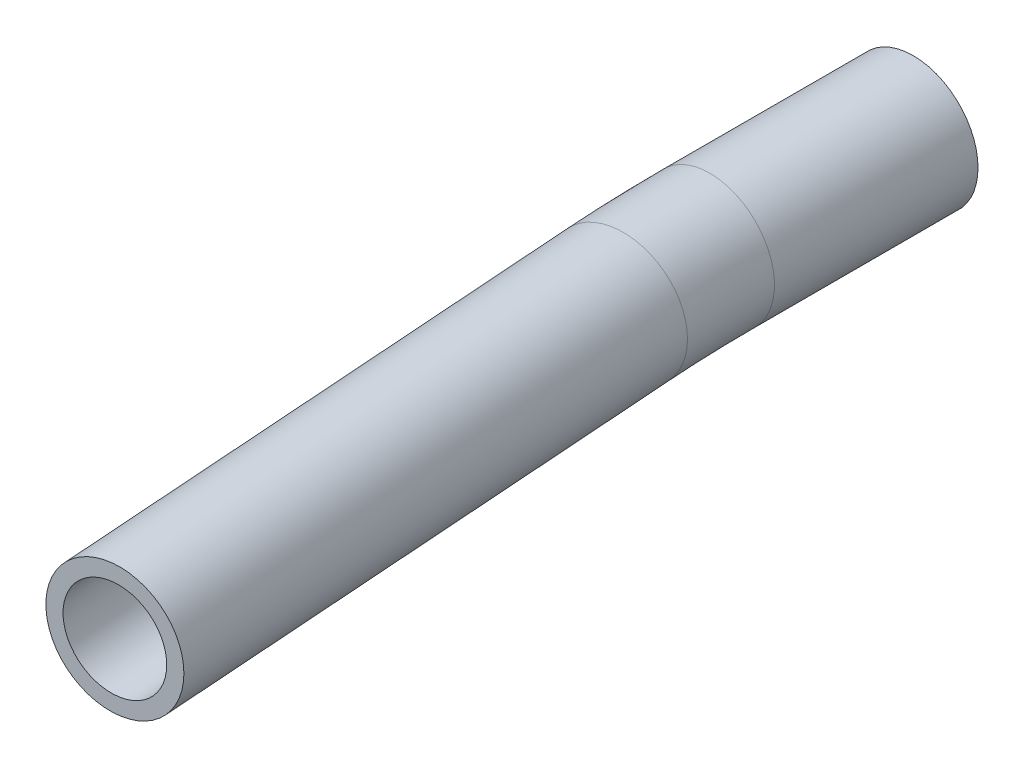
ISO-10303-21;
HEADER;
FILE_DESCRIPTION(('STEP AP214'),'2;1');
FILE_NAME('part.step','',(''),(''),'','','');
FILE_SCHEMA(('AUTOMOTIVE_DESIGN { 1 0 10303 214 1 1 1 1 }'));
ENDSEC;
DATA;
#1=APPLICATION_CONTEXT('core data for automotive mechanical design processes');
#2=APPLICATION_PROTOCOL_DEFINITION('international standard','automotive_design',2000,#1);
#3=PRODUCT_CONTEXT('',#1,'mechanical');
#4=PRODUCT('Part','Part','',(#3));
#5=PRODUCT_RELATED_PRODUCT_CATEGORY('part','',(#4));
#6=PRODUCT_DEFINITION_FORMATION('','',#4);
#7=PRODUCT_DEFINITION_CONTEXT('part definition',#1,'design');
#8=PRODUCT_DEFINITION('design','',#6,#7);
#9=PRODUCT_DEFINITION_SHAPE('','',#8);
#10=(LENGTH_UNIT() NAMED_UNIT(*) SI_UNIT(.MILLI.,.METRE.));
#11=(NAMED_UNIT(*) PLANE_ANGLE_UNIT() SI_UNIT($,.RADIAN.));
#12=(NAMED_UNIT(*) SI_UNIT($,.STERADIAN.) SOLID_ANGLE_UNIT());
#13=UNCERTAINTY_MEASURE_WITH_UNIT(LENGTH_MEASURE(1.E-05),#10,'distance_accuracy_value','');
#14=(GEOMETRIC_REPRESENTATION_CONTEXT(3) GLOBAL_UNCERTAINTY_ASSIGNED_CONTEXT((#13)) GLOBAL_UNIT_ASSIGNED_CONTEXT((#10,
#11,#12)) REPRESENTATION_CONTEXT('',''));
#15=CARTESIAN_POINT('',(0.,0.,0.));
#16=DIRECTION('',(0.,0.,1.));
#17=DIRECTION('',(1.,0.,0.));
#18=AXIS2_PLACEMENT_3D('',#15,#16,#17);
#19=CARTESIAN_POINT('',(0.24359497401758,0.,21.9756473744125));
#20=DIRECTION('',(0.0697564737441256,0.,0.997564050259824));
#21=DIRECTION('',(0.997564050259824,0.,-0.0697564737441256));
#22=AXIS2_PLACEMENT_3D('',#19,#20,#21);
#23=CYLINDRICAL_SURFACE('',#22,4.765);
#24=CARTESIAN_POINT('',(0.24359497401758,0.,21.9756473744125));
#25=DIRECTION('',(0.0697564737441252,0.,0.997564050259824));
#26=DIRECTION('',(0.997564050259824,0.,-0.0697564737441252));
#27=AXIS2_PLACEMENT_3D('',#24,#25,#26);
#28=CIRCLE('',#27,4.765);
#29=CARTESIAN_POINT('',(-4.5097977254705,0.,22.3080369718033));
#30=VERTEX_POINT('',#29);
#31=EDGE_CURVE('E39',#30,#30,#28,.T.);
#32=ORIENTED_EDGE('',*,*,#31,.T.);
#33=EDGE_LOOP('',(#32));
#34=FACE_BOUND('',#33,.T.);
#35=CARTESIAN_POINT('',(3.03385392378261,0.,61.8782093848055));
#36=DIRECTION('',(0.0697564737441252,0.,0.997564050259824));
#37=DIRECTION('',(0.997564050259824,0.,-0.0697564737441252));
#38=AXIS2_PLACEMENT_3D('',#35,#36,#37);
#39=CIRCLE('',#38,4.765);
#40=CARTESIAN_POINT('',(7.78724662327067,0.,61.5458197874148));
#41=VERTEX_POINT('',#40);
#42=EDGE_CURVE('E10',#41,#41,#39,.T.);
#43=ORIENTED_EDGE('',*,*,#42,.F.);
#44=EDGE_LOOP('',(#43));
#45=FACE_BOUND('',#44,.T.);
#46=ADVANCED_FACE('F29',(#34,#45),#23,.T.);
#47=CARTESIAN_POINT('',(0.24359497401758,0.,21.9756473744125));
#48=DIRECTION('',(0.0697564737441256,0.,0.997564050259824));
#49=DIRECTION('',(0.997564050259824,0.,-0.0697564737441256));
#50=AXIS2_PLACEMENT_3D('',#47,#48,#49);
#51=CYLINDRICAL_SURFACE('',#50,3.58);
#52=CARTESIAN_POINT('',(0.24359497401758,0.,21.9756473744125));
#53=DIRECTION('',(0.0697564737441252,0.,0.997564050259824));
#54=DIRECTION('',(0.997564050259824,0.,-0.0697564737441252));
#55=AXIS2_PLACEMENT_3D('',#52,#53,#54);
#56=CIRCLE('',#55,3.58);
#57=CARTESIAN_POINT('',(-3.3276843259126,0.,22.2253755504165));
#58=VERTEX_POINT('',#57);
#59=EDGE_CURVE('E43',#58,#58,#56,.T.);
#60=ORIENTED_EDGE('',*,*,#59,.F.);
#61=EDGE_LOOP('',(#60));
#62=FACE_BOUND('',#61,.T.);
#63=CARTESIAN_POINT('',(3.03385392378261,0.,61.8782093848055));
#64=DIRECTION('',(0.0697564737441252,0.,0.997564050259824));
#65=DIRECTION('',(0.997564050259824,0.,-0.0697564737441252));
#66=AXIS2_PLACEMENT_3D('',#63,#64,#65);
#67=CIRCLE('',#66,3.58);
#68=CARTESIAN_POINT('',(6.60513322371278,0.,61.6284812088015));
#69=VERTEX_POINT('',#68);
#70=EDGE_CURVE('E35',#69,#69,#67,.T.);
#71=ORIENTED_EDGE('',*,*,#70,.T.);
#72=EDGE_LOOP('',(#71));
#73=FACE_BOUND('',#72,.T.);
#74=ADVANCED_FACE('F71',(#62,#73),#51,.F.);
#75=CARTESIAN_POINT('',(100.,0.,15.));
#76=DIRECTION('',(0.,1.,0.));
#77=DIRECTION('',(0.,0.,1.));
#78=AXIS2_PLACEMENT_3D('',#75,#76,#77);
#79=TOROIDAL_SURFACE('',#78,100.,4.765);
#80=CARTESIAN_POINT('',(0.,0.,15.));
#81=DIRECTION('',(0.,0.,1.));
#82=DIRECTION('',(1.,0.,0.));
#83=AXIS2_PLACEMENT_3D('',#80,#81,#82);
#84=CIRCLE('',#83,4.765);
#85=CARTESIAN_POINT('',(-4.76500000000001,0.,15.));
#86=VERTEX_POINT('',#85);
#87=EDGE_CURVE('E48',#86,#86,#84,.T.);
#88=CARTESIAN_POINT('',(100.,0.,15.));
#89=DIRECTION('',(0.,1.,0.));
#90=DIRECTION('',(0.,0.,1.));
#91=AXIS2_PLACEMENT_3D('',#88,#89,#90);
#92=CIRCLE('',#91,104.765);
#93=EDGE_CURVE('',#86,#30,#92,.T.);
#94=ORIENTED_EDGE('',*,*,#87,.T.);
#95=ORIENTED_EDGE('',*,*,#31,.F.);
#96=ORIENTED_EDGE('',*,*,#93,.T.);
#97=ORIENTED_EDGE('',*,*,#93,.F.);
#98=EDGE_LOOP('',(#94,#96,#95,#97));
#99=FACE_BOUND('',#98,.T.);
#100=ADVANCED_FACE('F67',(#99),#79,.T.);
#101=CARTESIAN_POINT('',(100.,0.,15.));
#102=DIRECTION('',(0.,1.,0.));
#103=DIRECTION('',(0.,0.,1.));
#104=AXIS2_PLACEMENT_3D('',#101,#102,#103);
#105=TOROIDAL_SURFACE('',#104,100.,3.58);
#106=CARTESIAN_POINT('',(0.,0.,15.));
#107=DIRECTION('',(0.,0.,1.));
#108=DIRECTION('',(1.,0.,0.));
#109=AXIS2_PLACEMENT_3D('',#106,#107,#108);
#110=CIRCLE('',#109,3.58);
#111=CARTESIAN_POINT('',(-3.58,0.,15.));
#112=VERTEX_POINT('',#111);
#113=EDGE_CURVE('E52',#112,#112,#110,.T.);
#114=CARTESIAN_POINT('',(100.,0.,15.));
#115=DIRECTION('',(0.,1.,0.));
#116=DIRECTION('',(0.,0.,1.));
#117=AXIS2_PLACEMENT_3D('',#114,#115,#116);
#118=CIRCLE('',#117,103.58);
#119=EDGE_CURVE('',#112,#58,#118,.T.);
#120=ORIENTED_EDGE('',*,*,#113,.F.);
#121=ORIENTED_EDGE('',*,*,#59,.T.);
#122=ORIENTED_EDGE('',*,*,#119,.T.);
#123=ORIENTED_EDGE('',*,*,#119,.F.);
#124=EDGE_LOOP('',(#120,#122,#121,#123));
#125=FACE_BOUND('',#124,.T.);
#126=ADVANCED_FACE('F64',(#125),#105,.F.);
#127=CARTESIAN_POINT('',(0.,0.,15.));
#128=DIRECTION('',(0.,0.,-1.));
#129=DIRECTION('',(-1.,0.,0.));
#130=AXIS2_PLACEMENT_3D('',#127,#128,#129);
#131=CYLINDRICAL_SURFACE('',#130,3.58);
#132=ORIENTED_EDGE('',*,*,#113,.T.);
#133=EDGE_LOOP('',(#132));
#134=FACE_BOUND('',#133,.T.);
#135=CARTESIAN_POINT('',(0.,0.,0.));
#136=DIRECTION('',(0.,0.,1.));
#137=DIRECTION('',(1.,0.,0.));
#138=AXIS2_PLACEMENT_3D('',#135,#136,#137);
#139=CIRCLE('',#138,3.58);
#140=CARTESIAN_POINT('',(3.58,0.,0.));
#141=VERTEX_POINT('',#140);
#142=EDGE_CURVE('E53',#141,#141,#139,.T.);
#143=ORIENTED_EDGE('',*,*,#142,.F.);
#144=EDGE_LOOP('',(#143));
#145=FACE_BOUND('',#144,.T.);
#146=ADVANCED_FACE('F61',(#134,#145),#131,.F.);
#147=CARTESIAN_POINT('',(0.,0.,15.));
#148=DIRECTION('',(0.,0.,-1.));
#149=DIRECTION('',(-1.,0.,0.));
#150=AXIS2_PLACEMENT_3D('',#147,#148,#149);
#151=CYLINDRICAL_SURFACE('',#150,4.765);
#152=ORIENTED_EDGE('',*,*,#87,.F.);
#153=EDGE_LOOP('',(#152));
#154=FACE_BOUND('',#153,.T.);
#155=CARTESIAN_POINT('',(0.,0.,0.));
#156=DIRECTION('',(0.,0.,1.));
#157=DIRECTION('',(1.,0.,0.));
#158=AXIS2_PLACEMENT_3D('',#155,#156,#157);
#159=CIRCLE('',#158,4.765);
#160=CARTESIAN_POINT('',(4.765,0.,0.));
#161=VERTEX_POINT('',#160);
#162=EDGE_CURVE('E49',#161,#161,#159,.T.);
#163=ORIENTED_EDGE('',*,*,#162,.T.);
#164=EDGE_LOOP('',(#163));
#165=FACE_BOUND('',#164,.T.);
#166=ADVANCED_FACE('F83',(#154,#165),#151,.T.);
#167=CARTESIAN_POINT('',(3.03385392378261,0.,61.8782093848055));
#168=DIRECTION('',(0.0697564737441252,0.,0.997564050259824));
#169=DIRECTION('',(0.997564050259824,0.,-0.0697564737441252));
#170=AXIS2_PLACEMENT_3D('',#167,#168,#169);
#171=PLANE('',#170);
#172=ORIENTED_EDGE('',*,*,#70,.F.);
#173=EDGE_LOOP('',(#172));
#174=FACE_BOUND('',#173,.T.);
#175=ORIENTED_EDGE('',*,*,#42,.T.);
#176=EDGE_LOOP('',(#175));
#177=FACE_BOUND('',#176,.T.);
#178=ADVANCED_FACE('F86',(#174,#177),#171,.T.);
#179=CARTESIAN_POINT('',(0.,0.,0.));
#180=DIRECTION('',(0.,0.,1.));
#181=DIRECTION('',(1.,0.,0.));
#182=AXIS2_PLACEMENT_3D('',#179,#180,#181);
#183=PLANE('',#182);
#184=ORIENTED_EDGE('',*,*,#142,.T.);
#185=EDGE_LOOP('',(#184));
#186=FACE_BOUND('',#185,.T.);
#187=ORIENTED_EDGE('',*,*,#162,.F.);
#188=EDGE_LOOP('',(#187));
#189=FACE_BOUND('',#188,.T.);
#190=ADVANCED_FACE('F88',(#186,#189),#183,.F.);
#191=CLOSED_SHELL('',(#46,#74,#100,#126,#146,#166,#178,#190));
#192=MANIFOLD_SOLID_BREP('B2',#191);
#193=ADVANCED_BREP_SHAPE_REPRESENTATION('',(#18,#192),#14);
#194=SHAPE_DEFINITION_REPRESENTATION(#9,#193);
ENDSEC;
END-ISO-10303-21;
